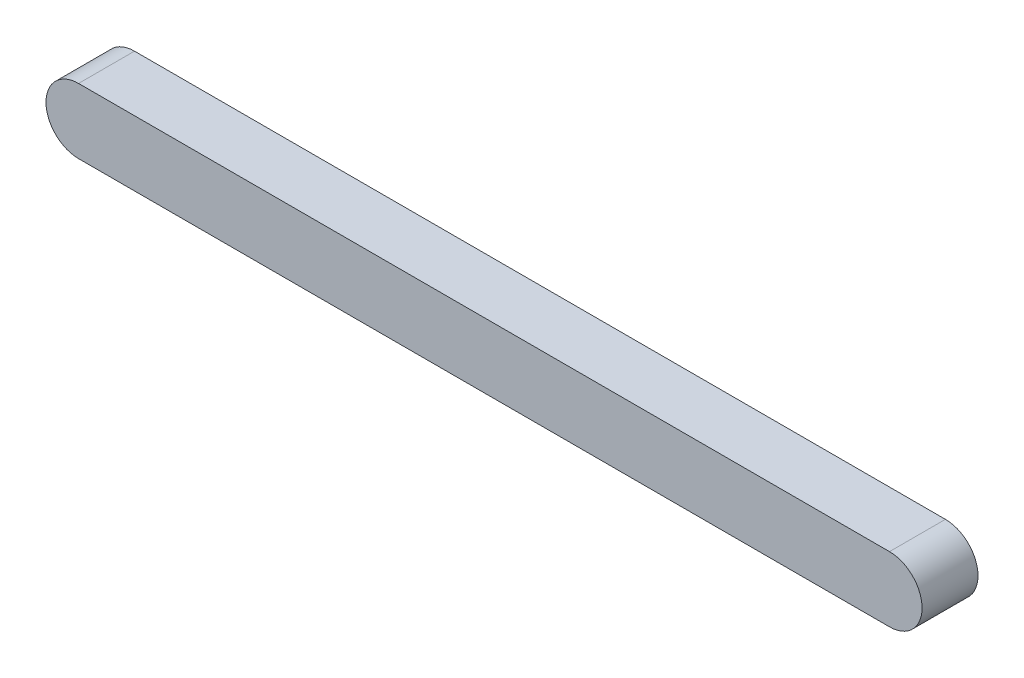
ISO-10303-21;
HEADER;
FILE_DESCRIPTION(('STEP AP214'),'2;1');
FILE_NAME('part.step','',(''),(''),'','','');
FILE_SCHEMA(('AUTOMOTIVE_DESIGN { 1 0 10303 214 1 1 1 1 }'));
ENDSEC;
DATA;
#1=APPLICATION_CONTEXT('core data for automotive mechanical design processes');
#2=APPLICATION_PROTOCOL_DEFINITION('international standard','automotive_design',2000,#1);
#3=PRODUCT_CONTEXT('',#1,'mechanical');
#4=PRODUCT('Part','Part','',(#3));
#5=PRODUCT_RELATED_PRODUCT_CATEGORY('part','',(#4));
#6=PRODUCT_DEFINITION_FORMATION('','',#4);
#7=PRODUCT_DEFINITION_CONTEXT('part definition',#1,'design');
#8=PRODUCT_DEFINITION('design','',#6,#7);
#9=PRODUCT_DEFINITION_SHAPE('','',#8);
#10=(LENGTH_UNIT() NAMED_UNIT(*) SI_UNIT(.MILLI.,.METRE.));
#11=(NAMED_UNIT(*) PLANE_ANGLE_UNIT() SI_UNIT($,.RADIAN.));
#12=(NAMED_UNIT(*) SI_UNIT($,.STERADIAN.) SOLID_ANGLE_UNIT());
#13=UNCERTAINTY_MEASURE_WITH_UNIT(LENGTH_MEASURE(1.E-05),#10,'distance_accuracy_value','');
#14=(GEOMETRIC_REPRESENTATION_CONTEXT(3) GLOBAL_UNCERTAINTY_ASSIGNED_CONTEXT((#13)) GLOBAL_UNIT_ASSIGNED_CONTEXT((#10,
#11,#12)) REPRESENTATION_CONTEXT('',''));
#15=CARTESIAN_POINT('',(0.,0.,0.));
#16=DIRECTION('',(0.,0.,1.));
#17=DIRECTION('',(1.,0.,0.));
#18=AXIS2_PLACEMENT_3D('',#15,#16,#17);
#19=CARTESIAN_POINT('',(-145.,0.,10.));
#20=DIRECTION('',(0.,0.,-1.));
#21=DIRECTION('',(-1.,0.,0.));
#22=AXIS2_PLACEMENT_3D('',#19,#20,#21);
#23=CYLINDRICAL_SURFACE('',#22,5.82531278638876);
#24=CARTESIAN_POINT('',(-145.,0.,0.));
#25=DIRECTION('',(0.,0.,1.));
#26=DIRECTION('',(1.,0.,0.));
#27=AXIS2_PLACEMENT_3D('',#24,#25,#26);
#28=CIRCLE('',#27,5.82531278638876);
#29=CARTESIAN_POINT('',(-145.,5.82531278638876,0.));
#30=VERTEX_POINT('',#29);
#31=CARTESIAN_POINT('',(-145.,-5.82531278638876,0.));
#32=VERTEX_POINT('',#31);
#33=EDGE_CURVE('E97',#30,#32,#28,.T.);
#34=ORIENTED_EDGE('',*,*,#33,.T.);
#35=DIRECTION('',(0.,0.,-1.));
#36=VECTOR('',#35,1.);
#37=CARTESIAN_POINT('',(-145.,-5.82531278638876,10.));
#38=LINE('',#37,#36);
#39=CARTESIAN_POINT('',(-145.,-5.82531278638876,10.));
#40=VERTEX_POINT('',#39);
#41=EDGE_CURVE('E11',#40,#32,#38,.T.);
#42=ORIENTED_EDGE('',*,*,#41,.F.);
#43=CARTESIAN_POINT('',(-145.,0.,10.));
#44=DIRECTION('',(0.,0.,1.));
#45=DIRECTION('',(1.,0.,0.));
#46=AXIS2_PLACEMENT_3D('',#43,#44,#45);
#47=CIRCLE('',#46,5.82531278638876);
#48=CARTESIAN_POINT('',(-145.,5.82531278638876,10.));
#49=VERTEX_POINT('',#48);
#50=EDGE_CURVE('E85',#49,#40,#47,.T.);
#51=ORIENTED_EDGE('',*,*,#50,.F.);
#52=DIRECTION('',(0.,0.,-1.));
#53=VECTOR('',#52,1.);
#54=CARTESIAN_POINT('',(-145.,5.82531278638876,10.));
#55=LINE('',#54,#53);
#56=EDGE_CURVE('E93',#49,#30,#55,.T.);
#57=ORIENTED_EDGE('',*,*,#56,.T.);
#58=EDGE_LOOP('',(#34,#42,#51,#57));
#59=FACE_BOUND('',#58,.T.);
#60=ADVANCED_FACE('F34',(#59),#23,.T.);
#61=CARTESIAN_POINT('',(-145.,-5.82531278638876,10.));
#62=DIRECTION('',(0.,1.,0.));
#63=DIRECTION('',(-1.,0.,0.));
#64=AXIS2_PLACEMENT_3D('',#61,#62,#63);
#65=PLANE('',#64);
#66=DIRECTION('',(1.,0.,0.));
#67=VECTOR('',#66,1.);
#68=CARTESIAN_POINT('',(-145.,-5.82531278638876,0.));
#69=LINE('',#68,#67);
#70=CARTESIAN_POINT('',(0.,-5.82531278638877,0.));
#71=VERTEX_POINT('',#70);
#72=EDGE_CURVE('E89',#32,#71,#69,.T.);
#73=ORIENTED_EDGE('',*,*,#72,.T.);
#74=DIRECTION('',(0.,0.,-1.));
#75=VECTOR('',#74,1.);
#76=CARTESIAN_POINT('',(0.,-5.82531278638877,10.));
#77=LINE('',#76,#75);
#78=CARTESIAN_POINT('',(0.,-5.82531278638877,10.));
#79=VERTEX_POINT('',#78);
#80=EDGE_CURVE('E42',#79,#71,#77,.T.);
#81=ORIENTED_EDGE('',*,*,#80,.F.);
#82=DIRECTION('',(1.,0.,0.));
#83=VECTOR('',#82,1.);
#84=CARTESIAN_POINT('',(-145.,-5.82531278638876,10.));
#85=LINE('',#84,#83);
#86=EDGE_CURVE('E80',#40,#79,#85,.T.);
#87=ORIENTED_EDGE('',*,*,#86,.F.);
#88=ORIENTED_EDGE('',*,*,#41,.T.);
#89=EDGE_LOOP('',(#73,#81,#87,#88));
#90=FACE_BOUND('',#89,.T.);
#91=ADVANCED_FACE('F88',(#90),#65,.F.);
#92=CARTESIAN_POINT('',(0.,0.,10.));
#93=DIRECTION('',(0.,0.,-1.));
#94=DIRECTION('',(-1.,0.,0.));
#95=AXIS2_PLACEMENT_3D('',#92,#93,#94);
#96=CYLINDRICAL_SURFACE('',#95,5.82531278638877);
#97=CARTESIAN_POINT('',(0.,0.,0.));
#98=DIRECTION('',(0.,0.,1.));
#99=DIRECTION('',(1.,0.,0.));
#100=AXIS2_PLACEMENT_3D('',#97,#98,#99);
#101=CIRCLE('',#100,5.82531278638877);
#102=CARTESIAN_POINT('',(0.,5.82531278638877,0.));
#103=VERTEX_POINT('',#102);
#104=EDGE_CURVE('E67',#71,#103,#101,.T.);
#105=ORIENTED_EDGE('',*,*,#104,.T.);
#106=DIRECTION('',(0.,0.,-1.));
#107=VECTOR('',#106,1.);
#108=CARTESIAN_POINT('',(0.,5.82531278638877,10.));
#109=LINE('',#108,#107);
#110=CARTESIAN_POINT('',(0.,5.82531278638877,10.));
#111=VERTEX_POINT('',#110);
#112=EDGE_CURVE('E90',#111,#103,#109,.T.);
#113=ORIENTED_EDGE('',*,*,#112,.F.);
#114=CARTESIAN_POINT('',(0.,0.,10.));
#115=DIRECTION('',(0.,0.,1.));
#116=DIRECTION('',(1.,0.,0.));
#117=AXIS2_PLACEMENT_3D('',#114,#115,#116);
#118=CIRCLE('',#117,5.82531278638877);
#119=EDGE_CURVE('E83',#79,#111,#118,.T.);
#120=ORIENTED_EDGE('',*,*,#119,.F.);
#121=ORIENTED_EDGE('',*,*,#80,.T.);
#122=EDGE_LOOP('',(#105,#113,#120,#121));
#123=FACE_BOUND('',#122,.T.);
#124=ADVANCED_FACE('F91',(#123),#96,.T.);
#125=CARTESIAN_POINT('',(-145.,5.82531278638876,10.));
#126=DIRECTION('',(0.,-1.,0.));
#127=DIRECTION('',(1.,0.,0.));
#128=AXIS2_PLACEMENT_3D('',#125,#126,#127);
#129=PLANE('',#128);
#130=DIRECTION('',(-1.,0.,0.));
#131=VECTOR('',#130,1.);
#132=CARTESIAN_POINT('',(-145.,5.82531278638876,0.));
#133=LINE('',#132,#131);
#134=EDGE_CURVE('E73',#103,#30,#133,.T.);
#135=ORIENTED_EDGE('',*,*,#134,.T.);
#136=ORIENTED_EDGE('',*,*,#56,.F.);
#137=DIRECTION('',(-1.,0.,0.));
#138=VECTOR('',#137,1.);
#139=CARTESIAN_POINT('',(-145.,5.82531278638876,10.));
#140=LINE('',#139,#138);
#141=EDGE_CURVE('E50',#111,#49,#140,.T.);
#142=ORIENTED_EDGE('',*,*,#141,.F.);
#143=ORIENTED_EDGE('',*,*,#112,.T.);
#144=EDGE_LOOP('',(#135,#136,#142,#143));
#145=FACE_BOUND('',#144,.T.);
#146=ADVANCED_FACE('F104',(#145),#129,.F.);
#147=CARTESIAN_POINT('',(-145.,0.,10.));
#148=DIRECTION('',(0.,0.,1.));
#149=DIRECTION('',(1.,0.,0.));
#150=AXIS2_PLACEMENT_3D('',#147,#148,#149);
#151=PLANE('',#150);
#152=ORIENTED_EDGE('',*,*,#50,.T.);
#153=ORIENTED_EDGE('',*,*,#86,.T.);
#154=ORIENTED_EDGE('',*,*,#119,.T.);
#155=ORIENTED_EDGE('',*,*,#141,.T.);
#156=EDGE_LOOP('',(#152,#153,#154,#155));
#157=FACE_BOUND('',#156,.T.);
#158=ADVANCED_FACE('F81',(#157),#151,.T.);
#159=CARTESIAN_POINT('',(-145.,0.,0.));
#160=DIRECTION('',(0.,0.,1.));
#161=DIRECTION('',(1.,0.,0.));
#162=AXIS2_PLACEMENT_3D('',#159,#160,#161);
#163=PLANE('',#162);
#164=ORIENTED_EDGE('',*,*,#33,.F.);
#165=ORIENTED_EDGE('',*,*,#134,.F.);
#166=ORIENTED_EDGE('',*,*,#104,.F.);
#167=ORIENTED_EDGE('',*,*,#72,.F.);
#168=EDGE_LOOP('',(#164,#165,#166,#167));
#169=FACE_BOUND('',#168,.T.);
#170=ADVANCED_FACE('F107',(#169),#163,.F.);
#171=CLOSED_SHELL('',(#60,#91,#124,#146,#158,#170));
#172=MANIFOLD_SOLID_BREP('B2',#171);
#173=ADVANCED_BREP_SHAPE_REPRESENTATION('',(#18,#172),#14);
#174=SHAPE_DEFINITION_REPRESENTATION(#9,#173);
ENDSEC;
END-ISO-10303-21;
